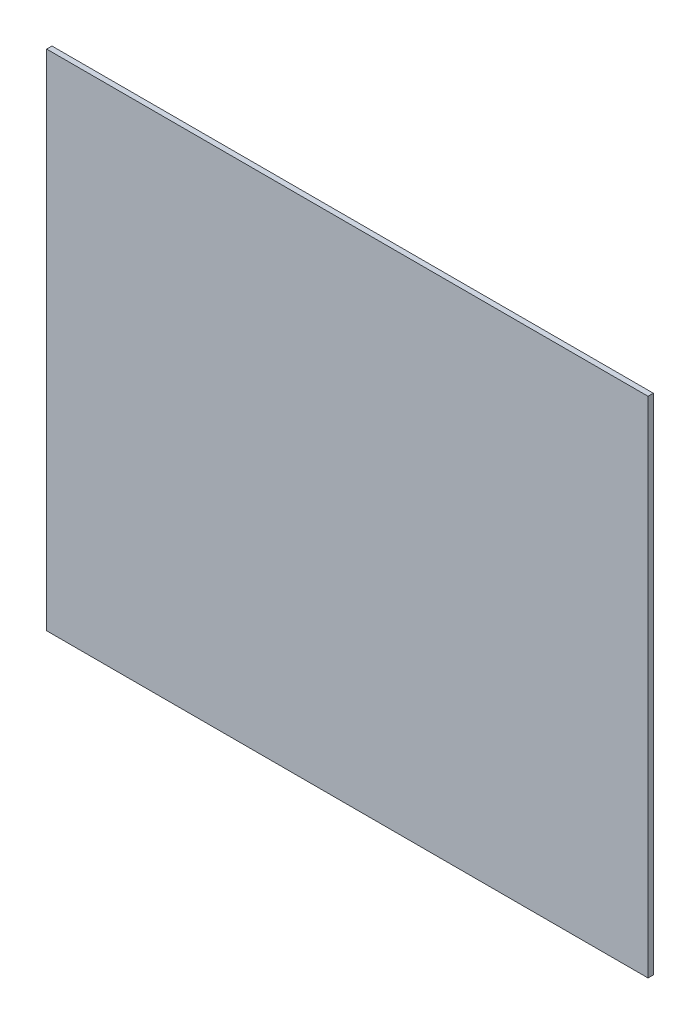
ISO-10303-21;
HEADER;
FILE_DESCRIPTION(('STEP AP214'),'2;1');
FILE_NAME('part.step','',(''),(''),'','','');
FILE_SCHEMA(('AUTOMOTIVE_DESIGN { 1 0 10303 214 1 1 1 1 }'));
ENDSEC;
DATA;
#1=APPLICATION_CONTEXT('core data for automotive mechanical design processes');
#2=APPLICATION_PROTOCOL_DEFINITION('international standard','automotive_design',2000,#1);
#3=PRODUCT_CONTEXT('',#1,'mechanical');
#4=PRODUCT('Part','Part','',(#3));
#5=PRODUCT_RELATED_PRODUCT_CATEGORY('part','',(#4));
#6=PRODUCT_DEFINITION_FORMATION('','',#4);
#7=PRODUCT_DEFINITION_CONTEXT('part definition',#1,'design');
#8=PRODUCT_DEFINITION('design','',#6,#7);
#9=PRODUCT_DEFINITION_SHAPE('','',#8);
#10=(LENGTH_UNIT() NAMED_UNIT(*) SI_UNIT(.MILLI.,.METRE.));
#11=(NAMED_UNIT(*) PLANE_ANGLE_UNIT() SI_UNIT($,.RADIAN.));
#12=(NAMED_UNIT(*) SI_UNIT($,.STERADIAN.) SOLID_ANGLE_UNIT());
#13=UNCERTAINTY_MEASURE_WITH_UNIT(LENGTH_MEASURE(1.E-05),#10,'distance_accuracy_value','');
#14=(GEOMETRIC_REPRESENTATION_CONTEXT(3) GLOBAL_UNCERTAINTY_ASSIGNED_CONTEXT((#13)) GLOBAL_UNIT_ASSIGNED_CONTEXT((#10,
#11,#12)) REPRESENTATION_CONTEXT('',''));
#15=CARTESIAN_POINT('',(0.,0.,0.));
#16=DIRECTION('',(0.,0.,1.));
#17=DIRECTION('',(1.,0.,0.));
#18=AXIS2_PLACEMENT_3D('',#15,#16,#17);
#19=CARTESIAN_POINT('',(-85.0963593866301,56.1991428613719,3.));
#20=DIRECTION('',(1.,0.,0.));
#21=DIRECTION('',(0.,0.,-1.));
#22=AXIS2_PLACEMENT_3D('',#19,#20,#21);
#23=PLANE('',#22);
#24=DIRECTION('',(0.,-1.,0.));
#25=VECTOR('',#24,1.);
#26=CARTESIAN_POINT('',(-85.0963593866301,56.1991428613719,0.));
#27=LINE('',#26,#25);
#28=CARTESIAN_POINT('',(-85.0963593866301,56.1991428613719,0.));
#29=VERTEX_POINT('',#28);
#30=CARTESIAN_POINT('',(-85.0963593866301,-227.800857138628,0.));
#31=VERTEX_POINT('',#30);
#32=EDGE_CURVE('E98',#29,#31,#27,.T.);
#33=ORIENTED_EDGE('',*,*,#32,.T.);
#34=DIRECTION('',(0.,0.,-1.));
#35=VECTOR('',#34,1.);
#36=CARTESIAN_POINT('',(-85.0963593866301,-227.800857138628,3.));
#37=LINE('',#36,#35);
#38=CARTESIAN_POINT('',(-85.0963593866301,-227.800857138628,3.));
#39=VERTEX_POINT('',#38);
#40=EDGE_CURVE('E11',#39,#31,#37,.T.);
#41=ORIENTED_EDGE('',*,*,#40,.F.);
#42=DIRECTION('',(0.,-1.,0.));
#43=VECTOR('',#42,1.);
#44=CARTESIAN_POINT('',(-85.0963593866301,56.1991428613719,3.));
#45=LINE('',#44,#43);
#46=CARTESIAN_POINT('',(-85.0963593866301,56.1991428613719,3.));
#47=VERTEX_POINT('',#46);
#48=EDGE_CURVE('E86',#47,#39,#45,.T.);
#49=ORIENTED_EDGE('',*,*,#48,.F.);
#50=DIRECTION('',(0.,0.,-1.));
#51=VECTOR('',#50,1.);
#52=CARTESIAN_POINT('',(-85.0963593866301,56.1991428613719,3.));
#53=LINE('',#52,#51);
#54=EDGE_CURVE('E94',#47,#29,#53,.T.);
#55=ORIENTED_EDGE('',*,*,#54,.T.);
#56=EDGE_LOOP('',(#33,#41,#49,#55));
#57=FACE_BOUND('',#56,.T.);
#58=ADVANCED_FACE('F35',(#57),#23,.F.);
#59=CARTESIAN_POINT('',(253.90364061337,-227.800857138628,3.));
#60=DIRECTION('',(0.,1.,0.));
#61=DIRECTION('',(-1.,0.,0.));
#62=AXIS2_PLACEMENT_3D('',#59,#60,#61);
#63=PLANE('',#62);
#64=DIRECTION('',(1.,0.,0.));
#65=VECTOR('',#64,1.);
#66=CARTESIAN_POINT('',(253.90364061337,-227.800857138628,0.));
#67=LINE('',#66,#65);
#68=CARTESIAN_POINT('',(253.90364061337,-227.800857138628,0.));
#69=VERTEX_POINT('',#68);
#70=EDGE_CURVE('E90',#31,#69,#67,.T.);
#71=ORIENTED_EDGE('',*,*,#70,.T.);
#72=DIRECTION('',(0.,0.,-1.));
#73=VECTOR('',#72,1.);
#74=CARTESIAN_POINT('',(253.90364061337,-227.800857138628,3.));
#75=LINE('',#74,#73);
#76=CARTESIAN_POINT('',(253.90364061337,-227.800857138628,3.));
#77=VERTEX_POINT('',#76);
#78=EDGE_CURVE('E43',#77,#69,#75,.T.);
#79=ORIENTED_EDGE('',*,*,#78,.F.);
#80=DIRECTION('',(1.,0.,0.));
#81=VECTOR('',#80,1.);
#82=CARTESIAN_POINT('',(253.90364061337,-227.800857138628,3.));
#83=LINE('',#82,#81);
#84=EDGE_CURVE('E81',#39,#77,#83,.T.);
#85=ORIENTED_EDGE('',*,*,#84,.F.);
#86=ORIENTED_EDGE('',*,*,#40,.T.);
#87=EDGE_LOOP('',(#71,#79,#85,#86));
#88=FACE_BOUND('',#87,.T.);
#89=ADVANCED_FACE('F89',(#88),#63,.F.);
#90=CARTESIAN_POINT('',(253.90364061337,56.1991428613719,3.));
#91=DIRECTION('',(-1.,0.,0.));
#92=DIRECTION('',(0.,-1.,0.));
#93=AXIS2_PLACEMENT_3D('',#90,#91,#92);
#94=PLANE('',#93);
#95=DIRECTION('',(0.,1.,0.));
#96=VECTOR('',#95,1.);
#97=CARTESIAN_POINT('',(253.90364061337,56.1991428613719,0.));
#98=LINE('',#97,#96);
#99=CARTESIAN_POINT('',(253.90364061337,56.1991428613719,0.));
#100=VERTEX_POINT('',#99);
#101=EDGE_CURVE('E68',#69,#100,#98,.T.);
#102=ORIENTED_EDGE('',*,*,#101,.T.);
#103=DIRECTION('',(0.,0.,-1.));
#104=VECTOR('',#103,1.);
#105=CARTESIAN_POINT('',(253.90364061337,56.1991428613719,3.));
#106=LINE('',#105,#104);
#107=CARTESIAN_POINT('',(253.90364061337,56.1991428613719,3.));
#108=VERTEX_POINT('',#107);
#109=EDGE_CURVE('E91',#108,#100,#106,.T.);
#110=ORIENTED_EDGE('',*,*,#109,.F.);
#111=DIRECTION('',(0.,1.,0.));
#112=VECTOR('',#111,1.);
#113=CARTESIAN_POINT('',(253.90364061337,56.1991428613719,3.));
#114=LINE('',#113,#112);
#115=EDGE_CURVE('E84',#77,#108,#114,.T.);
#116=ORIENTED_EDGE('',*,*,#115,.F.);
#117=ORIENTED_EDGE('',*,*,#78,.T.);
#118=EDGE_LOOP('',(#102,#110,#116,#117));
#119=FACE_BOUND('',#118,.T.);
#120=ADVANCED_FACE('F92',(#119),#94,.F.);
#121=CARTESIAN_POINT('',(-85.0963593866301,56.1991428613719,3.));
#122=DIRECTION('',(0.,-1.,0.));
#123=DIRECTION('',(0.,0.,-1.));
#124=AXIS2_PLACEMENT_3D('',#121,#122,#123);
#125=PLANE('',#124);
#126=DIRECTION('',(-1.,0.,0.));
#127=VECTOR('',#126,1.);
#128=CARTESIAN_POINT('',(-85.0963593866301,56.1991428613719,0.));
#129=LINE('',#128,#127);
#130=EDGE_CURVE('E74',#100,#29,#129,.T.);
#131=ORIENTED_EDGE('',*,*,#130,.T.);
#132=ORIENTED_EDGE('',*,*,#54,.F.);
#133=DIRECTION('',(-1.,0.,0.));
#134=VECTOR('',#133,1.);
#135=CARTESIAN_POINT('',(-85.0963593866301,56.1991428613719,3.));
#136=LINE('',#135,#134);
#137=EDGE_CURVE('E51',#108,#47,#136,.T.);
#138=ORIENTED_EDGE('',*,*,#137,.F.);
#139=ORIENTED_EDGE('',*,*,#109,.T.);
#140=EDGE_LOOP('',(#131,#132,#138,#139));
#141=FACE_BOUND('',#140,.T.);
#142=ADVANCED_FACE('F105',(#141),#125,.F.);
#143=CARTESIAN_POINT('',(0.,0.,3.));
#144=DIRECTION('',(0.,0.,-1.));
#145=DIRECTION('',(-1.,0.,0.));
#146=AXIS2_PLACEMENT_3D('',#143,#144,#145);
#147=PLANE('',#146);
#148=ORIENTED_EDGE('',*,*,#48,.T.);
#149=ORIENTED_EDGE('',*,*,#84,.T.);
#150=ORIENTED_EDGE('',*,*,#115,.T.);
#151=ORIENTED_EDGE('',*,*,#137,.T.);
#152=EDGE_LOOP('',(#148,#149,#150,#151));
#153=FACE_BOUND('',#152,.T.);
#154=ADVANCED_FACE('F82',(#153),#147,.F.);
#155=CARTESIAN_POINT('',(0.,0.,0.));
#156=DIRECTION('',(0.,0.,-1.));
#157=DIRECTION('',(-1.,0.,0.));
#158=AXIS2_PLACEMENT_3D('',#155,#156,#157);
#159=PLANE('',#158);
#160=ORIENTED_EDGE('',*,*,#32,.F.);
#161=ORIENTED_EDGE('',*,*,#130,.F.);
#162=ORIENTED_EDGE('',*,*,#101,.F.);
#163=ORIENTED_EDGE('',*,*,#70,.F.);
#164=EDGE_LOOP('',(#160,#161,#162,#163));
#165=FACE_BOUND('',#164,.T.);
#166=ADVANCED_FACE('F108',(#165),#159,.T.);
#167=CLOSED_SHELL('',(#58,#89,#120,#142,#154,#166));
#168=MANIFOLD_SOLID_BREP('B2',#167);
#169=ADVANCED_BREP_SHAPE_REPRESENTATION('',(#18,#168),#14);
#170=SHAPE_DEFINITION_REPRESENTATION(#9,#169);
ENDSEC;
END-ISO-10303-21;
